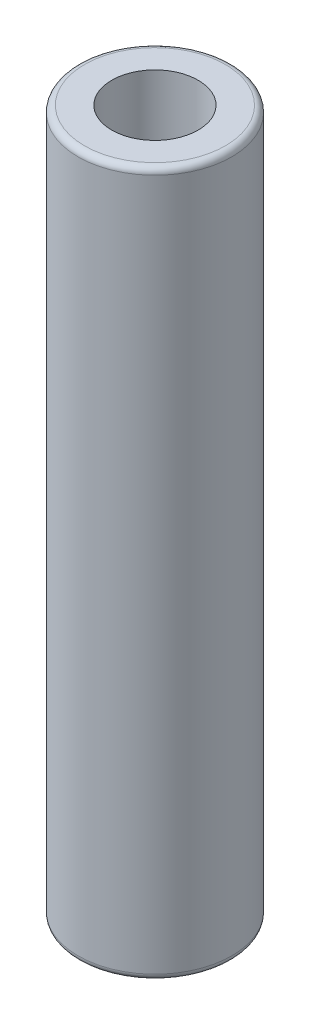
ISO-10303-21;
HEADER;
FILE_DESCRIPTION(('STEP AP214'),'2;1');
FILE_NAME('part.step','',(''),(''),'','','');
FILE_SCHEMA(('AUTOMOTIVE_DESIGN { 1 0 10303 214 1 1 1 1 }'));
ENDSEC;
DATA;
#1=APPLICATION_CONTEXT('core data for automotive mechanical design processes');
#2=APPLICATION_PROTOCOL_DEFINITION('international standard','automotive_design',2000,#1);
#3=PRODUCT_CONTEXT('',#1,'mechanical');
#4=PRODUCT('Part','Part','',(#3));
#5=PRODUCT_RELATED_PRODUCT_CATEGORY('part','',(#4));
#6=PRODUCT_DEFINITION_FORMATION('','',#4);
#7=PRODUCT_DEFINITION_CONTEXT('part definition',#1,'design');
#8=PRODUCT_DEFINITION('design','',#6,#7);
#9=PRODUCT_DEFINITION_SHAPE('','',#8);
#10=(LENGTH_UNIT() NAMED_UNIT(*) SI_UNIT(.MILLI.,.METRE.));
#11=(NAMED_UNIT(*) PLANE_ANGLE_UNIT() SI_UNIT($,.RADIAN.));
#12=(NAMED_UNIT(*) SI_UNIT($,.STERADIAN.) SOLID_ANGLE_UNIT());
#13=UNCERTAINTY_MEASURE_WITH_UNIT(LENGTH_MEASURE(1.E-05),#10,'distance_accuracy_value','');
#14=(GEOMETRIC_REPRESENTATION_CONTEXT(3) GLOBAL_UNCERTAINTY_ASSIGNED_CONTEXT((#13)) GLOBAL_UNIT_ASSIGNED_CONTEXT((#10,
#11,#12)) REPRESENTATION_CONTEXT('',''));
#15=CARTESIAN_POINT('',(0.,0.,0.));
#16=DIRECTION('',(0.,0.,1.));
#17=DIRECTION('',(1.,0.,0.));
#18=AXIS2_PLACEMENT_3D('',#15,#16,#17);
#19=CARTESIAN_POINT('',(0.,288.39215773182,0.));
#20=DIRECTION('',(0.,1.,0.));
#21=DIRECTION('',(0.,0.,1.));
#22=AXIS2_PLACEMENT_3D('',#19,#20,#21);
#23=CYLINDRICAL_SURFACE('',#22,9.52500000000003);
#24=CARTESIAN_POINT('',(0.,42.88155,0.));
#25=DIRECTION('',(0.,1.,0.));
#26=DIRECTION('',(0.,0.,1.));
#27=AXIS2_PLACEMENT_3D('',#24,#25,#26);
#28=CIRCLE('',#27,9.52500000000003);
#29=CARTESIAN_POINT('',(0.,42.88155,9.52500000000003));
#30=VERTEX_POINT('',#29);
#31=EDGE_CURVE('E11',#30,#30,#28,.T.);
#32=ORIENTED_EDGE('',*,*,#31,.F.);
#33=EDGE_LOOP('',(#32));
#34=FACE_BOUND('',#33,.T.);
#35=CARTESIAN_POINT('',(0.,-42.88155,0.));
#36=DIRECTION('',(0.,1.,0.));
#37=DIRECTION('',(0.,0.,1.));
#38=AXIS2_PLACEMENT_3D('',#35,#36,#37);
#39=CIRCLE('',#38,9.52500000000003);
#40=CARTESIAN_POINT('',(0.,-42.88155,9.52500000000003));
#41=VERTEX_POINT('',#40);
#42=EDGE_CURVE('E64',#41,#41,#39,.T.);
#43=ORIENTED_EDGE('',*,*,#42,.T.);
#44=EDGE_LOOP('',(#43));
#45=FACE_BOUND('',#44,.T.);
#46=ADVANCED_FACE('F37',(#34,#45),#23,.T.);
#47=CARTESIAN_POINT('',(0.,42.88155,0.));
#48=DIRECTION('',(0.,1.,0.));
#49=DIRECTION('',(0.,0.,1.));
#50=AXIS2_PLACEMENT_3D('',#47,#48,#49);
#51=TOROIDAL_SURFACE('',#50,8.73125000000003,0.79375);
#52=CARTESIAN_POINT('',(0.,43.6753,0.));
#53=DIRECTION('',(0.,1.,0.));
#54=DIRECTION('',(0.,0.,1.));
#55=AXIS2_PLACEMENT_3D('',#52,#53,#54);
#56=CIRCLE('',#55,8.73125000000003);
#57=CARTESIAN_POINT('',(0.,43.6753,8.73125000000003));
#58=VERTEX_POINT('',#57);
#59=EDGE_CURVE('E44',#58,#58,#56,.T.);
#60=ORIENTED_EDGE('',*,*,#59,.F.);
#61=EDGE_LOOP('',(#60));
#62=FACE_BOUND('',#61,.T.);
#63=ORIENTED_EDGE('',*,*,#31,.T.);
#64=EDGE_LOOP('',(#63));
#65=FACE_BOUND('',#64,.T.);
#66=ADVANCED_FACE('F81',(#62,#65),#51,.T.);
#67=CARTESIAN_POINT('',(0.,43.6753,0.));
#68=DIRECTION('',(0.,-1.,0.));
#69=DIRECTION('',(0.,0.,-1.));
#70=AXIS2_PLACEMENT_3D('',#67,#68,#69);
#71=PLANE('',#70);
#72=CARTESIAN_POINT('',(0.,43.6753,0.));
#73=DIRECTION('',(0.,1.,0.));
#74=DIRECTION('',(0.,0.,1.));
#75=AXIS2_PLACEMENT_3D('',#72,#73,#74);
#76=CIRCLE('',#75,5.35812999999999);
#77=CARTESIAN_POINT('',(0.,43.6753,5.35812999999999));
#78=VERTEX_POINT('',#77);
#79=EDGE_CURVE('E71',#78,#78,#76,.T.);
#80=ORIENTED_EDGE('',*,*,#79,.F.);
#81=EDGE_LOOP('',(#80));
#82=FACE_BOUND('',#81,.T.);
#83=ORIENTED_EDGE('',*,*,#59,.T.);
#84=EDGE_LOOP('',(#83));
#85=FACE_BOUND('',#84,.T.);
#86=ADVANCED_FACE('F79',(#82,#85),#71,.F.);
#87=CARTESIAN_POINT('',(0.,24.6253,0.));
#88=DIRECTION('',(0.,1.,0.));
#89=DIRECTION('',(0.,0.,1.));
#90=AXIS2_PLACEMENT_3D('',#87,#88,#89);
#91=CONICAL_SURFACE('',#90,5.35812999999999,1.02974425867665);
#92=CARTESIAN_POINT('',(0.,21.4058106913699,0.));
#93=VERTEX_POINT('',#92);
#94=VERTEX_LOOP('',#93);
#95=FACE_BOUND('',#94,.T.);
#96=CARTESIAN_POINT('',(0.,24.6253,0.));
#97=DIRECTION('',(0.,1.,0.));
#98=DIRECTION('',(0.,0.,1.));
#99=AXIS2_PLACEMENT_3D('',#96,#97,#98);
#100=CIRCLE('',#99,5.35812999999999);
#101=CARTESIAN_POINT('',(0.,24.6253,5.35812999999999));
#102=VERTEX_POINT('',#101);
#103=EDGE_CURVE('E74',#102,#102,#100,.T.);
#104=ORIENTED_EDGE('',*,*,#103,.T.);
#105=EDGE_LOOP('',(#104));
#106=FACE_BOUND('',#105,.T.);
#107=ADVANCED_FACE('F101',(#95,#106),#91,.F.);
#108=CARTESIAN_POINT('',(0.,43.6753,0.));
#109=DIRECTION('',(0.,1.,0.));
#110=DIRECTION('',(0.,0.,1.));
#111=AXIS2_PLACEMENT_3D('',#108,#109,#110);
#112=CYLINDRICAL_SURFACE('',#111,5.35812999999999);
#113=ORIENTED_EDGE('',*,*,#103,.F.);
#114=EDGE_LOOP('',(#113));
#115=FACE_BOUND('',#114,.T.);
#116=ORIENTED_EDGE('',*,*,#79,.T.);
#117=EDGE_LOOP('',(#116));
#118=FACE_BOUND('',#117,.T.);
#119=ADVANCED_FACE('F92',(#115,#118),#112,.F.);
#120=CARTESIAN_POINT('',(0.,-42.88155,0.));
#121=DIRECTION('',(0.,-1.,0.));
#122=DIRECTION('',(0.,0.,1.));
#123=AXIS2_PLACEMENT_3D('',#120,#121,#122);
#124=TOROIDAL_SURFACE('',#123,8.73125000000003,0.79375);
#125=CARTESIAN_POINT('',(0.,-43.6753,0.));
#126=DIRECTION('',(0.,1.,0.));
#127=DIRECTION('',(0.,0.,1.));
#128=AXIS2_PLACEMENT_3D('',#125,#126,#127);
#129=CIRCLE('',#128,8.73125000000003);
#130=CARTESIAN_POINT('',(0.,-43.6753,8.73125000000003));
#131=VERTEX_POINT('',#130);
#132=EDGE_CURVE('E60',#131,#131,#129,.T.);
#133=ORIENTED_EDGE('',*,*,#132,.T.);
#134=EDGE_LOOP('',(#133));
#135=FACE_BOUND('',#134,.T.);
#136=ORIENTED_EDGE('',*,*,#42,.F.);
#137=EDGE_LOOP('',(#136));
#138=FACE_BOUND('',#137,.T.);
#139=ADVANCED_FACE('F90',(#135,#138),#124,.T.);
#140=CARTESIAN_POINT('',(0.,-43.6753,0.));
#141=DIRECTION('',(0.,1.,0.));
#142=DIRECTION('',(0.,0.,-1.));
#143=AXIS2_PLACEMENT_3D('',#140,#141,#142);
#144=PLANE('',#143);
#145=CARTESIAN_POINT('',(0.,-43.6753,0.));
#146=DIRECTION('',(0.,1.,0.));
#147=DIRECTION('',(0.,0.,1.));
#148=AXIS2_PLACEMENT_3D('',#145,#146,#147);
#149=CIRCLE('',#148,5.35812999999999);
#150=CARTESIAN_POINT('',(0.,-43.6753,5.35812999999999));
#151=VERTEX_POINT('',#150);
#152=EDGE_CURVE('E61',#151,#151,#149,.T.);
#153=ORIENTED_EDGE('',*,*,#152,.T.);
#154=EDGE_LOOP('',(#153));
#155=FACE_BOUND('',#154,.T.);
#156=ORIENTED_EDGE('',*,*,#132,.F.);
#157=EDGE_LOOP('',(#156));
#158=FACE_BOUND('',#157,.T.);
#159=ADVANCED_FACE('F54',(#155,#158),#144,.F.);
#160=CARTESIAN_POINT('',(0.,-24.6253,0.));
#161=DIRECTION('',(0.,-1.,0.));
#162=DIRECTION('',(0.,0.,1.));
#163=AXIS2_PLACEMENT_3D('',#160,#161,#162);
#164=CONICAL_SURFACE('',#163,5.35812999999999,1.02974425867665);
#165=CARTESIAN_POINT('',(0.,-21.4058106913699,0.));
#166=VERTEX_POINT('',#165);
#167=VERTEX_LOOP('',#166);
#168=FACE_BOUND('',#167,.T.);
#169=CARTESIAN_POINT('',(0.,-24.6253,0.));
#170=DIRECTION('',(0.,1.,0.));
#171=DIRECTION('',(0.,0.,1.));
#172=AXIS2_PLACEMENT_3D('',#169,#170,#171);
#173=CIRCLE('',#172,5.35812999999999);
#174=CARTESIAN_POINT('',(0.,-24.6253,5.35812999999999));
#175=VERTEX_POINT('',#174);
#176=EDGE_CURVE('E58',#175,#175,#173,.T.);
#177=ORIENTED_EDGE('',*,*,#176,.F.);
#178=EDGE_LOOP('',(#177));
#179=FACE_BOUND('',#178,.T.);
#180=ADVANCED_FACE('F50',(#168,#179),#164,.F.);
#181=CARTESIAN_POINT('',(0.,-43.6753,0.));
#182=DIRECTION('',(0.,-1.,0.));
#183=DIRECTION('',(0.,0.,1.));
#184=AXIS2_PLACEMENT_3D('',#181,#182,#183);
#185=CYLINDRICAL_SURFACE('',#184,5.35812999999999);
#186=ORIENTED_EDGE('',*,*,#176,.T.);
#187=EDGE_LOOP('',(#186));
#188=FACE_BOUND('',#187,.T.);
#189=ORIENTED_EDGE('',*,*,#152,.F.);
#190=EDGE_LOOP('',(#189));
#191=FACE_BOUND('',#190,.T.);
#192=ADVANCED_FACE('F53',(#188,#191),#185,.F.);
#193=CLOSED_SHELL('',(#46,#66,#86,#107,#119,#139,#159,#180,#192));
#194=MANIFOLD_SOLID_BREP('B2',#193);
#195=ADVANCED_BREP_SHAPE_REPRESENTATION('',(#18,#194),#14);
#196=SHAPE_DEFINITION_REPRESENTATION(#9,#195);
ENDSEC;
END-ISO-10303-21;
